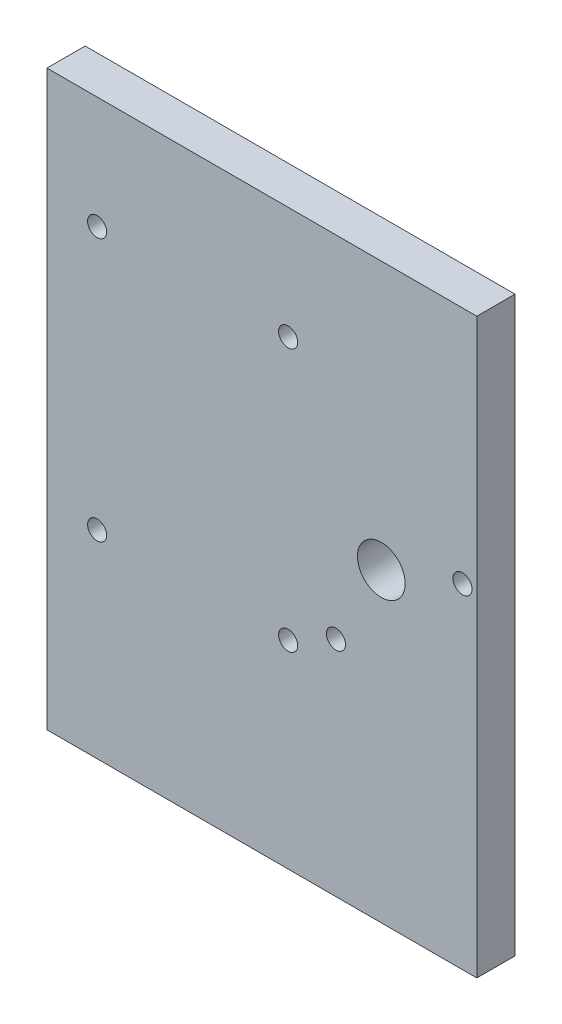
ISO-10303-21;
HEADER;
FILE_DESCRIPTION(('STEP AP214'),'2;1');
FILE_NAME('part.step','',(''),(''),'','','');
FILE_SCHEMA(('AUTOMOTIVE_DESIGN { 1 0 10303 214 1 1 1 1 }'));
ENDSEC;
DATA;
#1=APPLICATION_CONTEXT('core data for automotive mechanical design processes');
#2=APPLICATION_PROTOCOL_DEFINITION('international standard','automotive_design',2000,#1);
#3=PRODUCT_CONTEXT('',#1,'mechanical');
#4=PRODUCT('Part','Part','',(#3));
#5=PRODUCT_RELATED_PRODUCT_CATEGORY('part','',(#4));
#6=PRODUCT_DEFINITION_FORMATION('','',#4);
#7=PRODUCT_DEFINITION_CONTEXT('part definition',#1,'design');
#8=PRODUCT_DEFINITION('design','',#6,#7);
#9=PRODUCT_DEFINITION_SHAPE('','',#8);
#10=(LENGTH_UNIT() NAMED_UNIT(*) SI_UNIT(.MILLI.,.METRE.));
#11=(NAMED_UNIT(*) PLANE_ANGLE_UNIT() SI_UNIT($,.RADIAN.));
#12=(NAMED_UNIT(*) SI_UNIT($,.STERADIAN.) SOLID_ANGLE_UNIT());
#13=UNCERTAINTY_MEASURE_WITH_UNIT(LENGTH_MEASURE(1.E-05),#10,'distance_accuracy_value','');
#14=(GEOMETRIC_REPRESENTATION_CONTEXT(3) GLOBAL_UNCERTAINTY_ASSIGNED_CONTEXT((#13)) GLOBAL_UNIT_ASSIGNED_CONTEXT((#10,
#11,#12)) REPRESENTATION_CONTEXT('',''));
#15=CARTESIAN_POINT('',(0.,0.,0.));
#16=DIRECTION('',(0.,0.,1.));
#17=DIRECTION('',(1.,0.,0.));
#18=AXIS2_PLACEMENT_3D('',#15,#16,#17);
#19=CARTESIAN_POINT('',(0.,0.,8.));
#20=DIRECTION('',(1.,0.,0.));
#21=DIRECTION('',(0.,0.,-1.));
#22=AXIS2_PLACEMENT_3D('',#19,#20,#21);
#23=PLANE('',#22);
#24=DIRECTION('',(0.,-1.,0.));
#25=VECTOR('',#24,1.);
#26=CARTESIAN_POINT('',(0.,0.,0.));
#27=LINE('',#26,#25);
#28=CARTESIAN_POINT('',(0.,120.,0.));
#29=VERTEX_POINT('',#28);
#30=CARTESIAN_POINT('',(0.,0.,0.));
#31=VERTEX_POINT('',#30);
#32=EDGE_CURVE('E96',#29,#31,#27,.T.);
#33=ORIENTED_EDGE('',*,*,#32,.T.);
#34=DIRECTION('',(0.,0.,-1.));
#35=VECTOR('',#34,1.);
#36=CARTESIAN_POINT('',(0.,0.,8.));
#37=LINE('',#36,#35);
#38=CARTESIAN_POINT('',(0.,0.,8.));
#39=VERTEX_POINT('',#38);
#40=EDGE_CURVE('E11',#39,#31,#37,.T.);
#41=ORIENTED_EDGE('',*,*,#40,.F.);
#42=DIRECTION('',(0.,-1.,0.));
#43=VECTOR('',#42,1.);
#44=CARTESIAN_POINT('',(0.,0.,8.));
#45=LINE('',#44,#43);
#46=CARTESIAN_POINT('',(0.,120.,8.));
#47=VERTEX_POINT('',#46);
#48=EDGE_CURVE('E84',#47,#39,#45,.T.);
#49=ORIENTED_EDGE('',*,*,#48,.F.);
#50=DIRECTION('',(0.,0.,-1.));
#51=VECTOR('',#50,1.);
#52=CARTESIAN_POINT('',(0.,120.,8.));
#53=LINE('',#52,#51);
#54=EDGE_CURVE('E92',#47,#29,#53,.T.);
#55=ORIENTED_EDGE('',*,*,#54,.T.);
#56=EDGE_LOOP('',(#33,#41,#49,#55));
#57=FACE_BOUND('',#56,.T.);
#58=ADVANCED_FACE('F33',(#57),#23,.F.);
#59=CARTESIAN_POINT('',(0.,0.,8.));
#60=DIRECTION('',(0.,1.,0.));
#61=DIRECTION('',(0.,0.,1.));
#62=AXIS2_PLACEMENT_3D('',#59,#60,#61);
#63=PLANE('',#62);
#64=DIRECTION('',(1.,0.,0.));
#65=VECTOR('',#64,1.);
#66=CARTESIAN_POINT('',(0.,0.,0.));
#67=LINE('',#66,#65);
#68=CARTESIAN_POINT('',(90.,0.,0.));
#69=VERTEX_POINT('',#68);
#70=EDGE_CURVE('E88',#31,#69,#67,.T.);
#71=ORIENTED_EDGE('',*,*,#70,.T.);
#72=DIRECTION('',(0.,0.,-1.));
#73=VECTOR('',#72,1.);
#74=CARTESIAN_POINT('',(90.,0.,8.));
#75=LINE('',#74,#73);
#76=CARTESIAN_POINT('',(90.,0.,8.));
#77=VERTEX_POINT('',#76);
#78=EDGE_CURVE('E41',#77,#69,#75,.T.);
#79=ORIENTED_EDGE('',*,*,#78,.F.);
#80=DIRECTION('',(1.,0.,0.));
#81=VECTOR('',#80,1.);
#82=CARTESIAN_POINT('',(0.,0.,8.));
#83=LINE('',#82,#81);
#84=EDGE_CURVE('E79',#39,#77,#83,.T.);
#85=ORIENTED_EDGE('',*,*,#84,.F.);
#86=ORIENTED_EDGE('',*,*,#40,.T.);
#87=EDGE_LOOP('',(#71,#79,#85,#86));
#88=FACE_BOUND('',#87,.T.);
#89=ADVANCED_FACE('F87',(#88),#63,.F.);
#90=CARTESIAN_POINT('',(90.,0.,8.));
#91=DIRECTION('',(-1.,0.,0.));
#92=DIRECTION('',(0.,0.,1.));
#93=AXIS2_PLACEMENT_3D('',#90,#91,#92);
#94=PLANE('',#93);
#95=DIRECTION('',(0.,1.,0.));
#96=VECTOR('',#95,1.);
#97=CARTESIAN_POINT('',(90.,0.,0.));
#98=LINE('',#97,#96);
#99=CARTESIAN_POINT('',(90.,120.,0.));
#100=VERTEX_POINT('',#99);
#101=EDGE_CURVE('E66',#69,#100,#98,.T.);
#102=ORIENTED_EDGE('',*,*,#101,.T.);
#103=DIRECTION('',(0.,0.,-1.));
#104=VECTOR('',#103,1.);
#105=CARTESIAN_POINT('',(90.,120.,8.));
#106=LINE('',#105,#104);
#107=CARTESIAN_POINT('',(90.,120.,8.));
#108=VERTEX_POINT('',#107);
#109=EDGE_CURVE('E89',#108,#100,#106,.T.);
#110=ORIENTED_EDGE('',*,*,#109,.F.);
#111=DIRECTION('',(0.,1.,0.));
#112=VECTOR('',#111,1.);
#113=CARTESIAN_POINT('',(90.,0.,8.));
#114=LINE('',#113,#112);
#115=EDGE_CURVE('E82',#77,#108,#114,.T.);
#116=ORIENTED_EDGE('',*,*,#115,.F.);
#117=ORIENTED_EDGE('',*,*,#78,.T.);
#118=EDGE_LOOP('',(#102,#110,#116,#117));
#119=FACE_BOUND('',#118,.T.);
#120=ADVANCED_FACE('F90',(#119),#94,.F.);
#121=CARTESIAN_POINT('',(0.,120.,8.));
#122=DIRECTION('',(0.,-1.,0.));
#123=DIRECTION('',(0.,0.,-1.));
#124=AXIS2_PLACEMENT_3D('',#121,#122,#123);
#125=PLANE('',#124);
#126=DIRECTION('',(-1.,0.,0.));
#127=VECTOR('',#126,1.);
#128=CARTESIAN_POINT('',(0.,120.,0.));
#129=LINE('',#128,#127);
#130=EDGE_CURVE('E72',#100,#29,#129,.T.);
#131=ORIENTED_EDGE('',*,*,#130,.T.);
#132=ORIENTED_EDGE('',*,*,#54,.F.);
#133=DIRECTION('',(-1.,0.,0.));
#134=VECTOR('',#133,1.);
#135=CARTESIAN_POINT('',(0.,120.,8.));
#136=LINE('',#135,#134);
#137=EDGE_CURVE('E49',#108,#47,#136,.T.);
#138=ORIENTED_EDGE('',*,*,#137,.F.);
#139=ORIENTED_EDGE('',*,*,#109,.T.);
#140=EDGE_LOOP('',(#131,#132,#138,#139));
#141=FACE_BOUND('',#140,.T.);
#142=ADVANCED_FACE('F104',(#141),#125,.F.);
#143=CARTESIAN_POINT('',(0.,120.,8.));
#144=DIRECTION('',(0.,0.,-1.));
#145=DIRECTION('',(-1.,0.,0.));
#146=AXIS2_PLACEMENT_3D('',#143,#144,#145);
#147=PLANE('',#146);
#148=CARTESIAN_POINT('',(10.5,41.5,8.));
#149=DIRECTION('',(0.,0.,1.));
#150=DIRECTION('',(1.,0.,0.));
#151=AXIS2_PLACEMENT_3D('',#148,#149,#150);
#152=CIRCLE('',#151,2.);
#153=CARTESIAN_POINT('',(12.5,41.5,8.));
#154=VERTEX_POINT('',#153);
#155=EDGE_CURVE('E146',#154,#154,#152,.T.);
#156=ORIENTED_EDGE('',*,*,#155,.F.);
#157=EDGE_LOOP('',(#156));
#158=FACE_BOUND('',#157,.T.);
#159=CARTESIAN_POINT('',(50.5,41.5,8.));
#160=DIRECTION('',(0.,0.,1.));
#161=DIRECTION('',(1.,0.,0.));
#162=AXIS2_PLACEMENT_3D('',#159,#160,#161);
#163=CIRCLE('',#162,2.);
#164=CARTESIAN_POINT('',(52.5,41.5,8.));
#165=VERTEX_POINT('',#164);
#166=EDGE_CURVE('E140',#165,#165,#163,.T.);
#167=ORIENTED_EDGE('',*,*,#166,.F.);
#168=EDGE_LOOP('',(#167));
#169=FACE_BOUND('',#168,.T.);
#170=CARTESIAN_POINT('',(10.5,96.5,8.));
#171=DIRECTION('',(0.,0.,1.));
#172=DIRECTION('',(1.,0.,0.));
#173=AXIS2_PLACEMENT_3D('',#170,#171,#172);
#174=CIRCLE('',#173,2.);
#175=CARTESIAN_POINT('',(12.5,96.5,8.));
#176=VERTEX_POINT('',#175);
#177=EDGE_CURVE('E134',#176,#176,#174,.T.);
#178=ORIENTED_EDGE('',*,*,#177,.F.);
#179=EDGE_LOOP('',(#178));
#180=FACE_BOUND('',#179,.T.);
#181=CARTESIAN_POINT('',(50.5,96.5,8.));
#182=DIRECTION('',(0.,0.,1.));
#183=DIRECTION('',(1.,0.,0.));
#184=AXIS2_PLACEMENT_3D('',#181,#182,#183);
#185=CIRCLE('',#184,2.);
#186=CARTESIAN_POINT('',(52.5,96.5,8.));
#187=VERTEX_POINT('',#186);
#188=EDGE_CURVE('E128',#187,#187,#185,.T.);
#189=ORIENTED_EDGE('',*,*,#188,.F.);
#190=EDGE_LOOP('',(#189));
#191=FACE_BOUND('',#190,.T.);
#192=CARTESIAN_POINT('',(60.5,46.7,8.));
#193=DIRECTION('',(0.,0.,1.));
#194=DIRECTION('',(1.,0.,0.));
#195=AXIS2_PLACEMENT_3D('',#192,#193,#194);
#196=CIRCLE('',#195,2.);
#197=CARTESIAN_POINT('',(62.5,46.7,8.));
#198=VERTEX_POINT('',#197);
#199=EDGE_CURVE('E122',#198,#198,#196,.T.);
#200=ORIENTED_EDGE('',*,*,#199,.F.);
#201=EDGE_LOOP('',(#200));
#202=FACE_BOUND('',#201,.T.);
#203=CARTESIAN_POINT('',(87.,70.,8.));
#204=DIRECTION('',(0.,0.,1.));
#205=DIRECTION('',(1.,0.,0.));
#206=AXIS2_PLACEMENT_3D('',#203,#204,#205);
#207=CIRCLE('',#206,2.);
#208=CARTESIAN_POINT('',(89.,70.,8.));
#209=VERTEX_POINT('',#208);
#210=EDGE_CURVE('E116',#209,#209,#207,.T.);
#211=ORIENTED_EDGE('',*,*,#210,.F.);
#212=EDGE_LOOP('',(#211));
#213=FACE_BOUND('',#212,.T.);
#214=CARTESIAN_POINT('',(70.,64.,8.));
#215=DIRECTION('',(0.,0.,1.));
#216=DIRECTION('',(1.,0.,0.));
#217=AXIS2_PLACEMENT_3D('',#214,#215,#216);
#218=CIRCLE('',#217,5.00000000000001);
#219=CARTESIAN_POINT('',(75.,64.,8.));
#220=VERTEX_POINT('',#219);
#221=EDGE_CURVE('E110',#220,#220,#218,.T.);
#222=ORIENTED_EDGE('',*,*,#221,.F.);
#223=EDGE_LOOP('',(#222));
#224=FACE_BOUND('',#223,.T.);
#225=ORIENTED_EDGE('',*,*,#48,.T.);
#226=ORIENTED_EDGE('',*,*,#84,.T.);
#227=ORIENTED_EDGE('',*,*,#115,.T.);
#228=ORIENTED_EDGE('',*,*,#137,.T.);
#229=EDGE_LOOP('',(#225,#226,#227,#228));
#230=FACE_BOUND('',#229,.T.);
#231=ADVANCED_FACE('F80',(#158,#169,#180,#191,#202,#213,#224,#230),#147,.F.);
#232=CARTESIAN_POINT('',(0.,120.,0.));
#233=DIRECTION('',(0.,0.,-1.));
#234=DIRECTION('',(-1.,0.,0.));
#235=AXIS2_PLACEMENT_3D('',#232,#233,#234);
#236=PLANE('',#235);
#237=CARTESIAN_POINT('',(10.5,41.5,0.));
#238=DIRECTION('',(0.,0.,1.));
#239=DIRECTION('',(1.,0.,0.));
#240=AXIS2_PLACEMENT_3D('',#237,#238,#239);
#241=CIRCLE('',#240,2.);
#242=CARTESIAN_POINT('',(12.5,41.5,0.));
#243=VERTEX_POINT('',#242);
#244=EDGE_CURVE('E143',#243,#243,#241,.T.);
#245=ORIENTED_EDGE('',*,*,#244,.T.);
#246=EDGE_LOOP('',(#245));
#247=FACE_BOUND('',#246,.T.);
#248=CARTESIAN_POINT('',(50.5,41.5,0.));
#249=DIRECTION('',(0.,0.,1.));
#250=DIRECTION('',(1.,0.,0.));
#251=AXIS2_PLACEMENT_3D('',#248,#249,#250);
#252=CIRCLE('',#251,2.);
#253=CARTESIAN_POINT('',(52.5,41.5,0.));
#254=VERTEX_POINT('',#253);
#255=EDGE_CURVE('E137',#254,#254,#252,.T.);
#256=ORIENTED_EDGE('',*,*,#255,.T.);
#257=EDGE_LOOP('',(#256));
#258=FACE_BOUND('',#257,.T.);
#259=CARTESIAN_POINT('',(10.5,96.5,0.));
#260=DIRECTION('',(0.,0.,1.));
#261=DIRECTION('',(1.,0.,0.));
#262=AXIS2_PLACEMENT_3D('',#259,#260,#261);
#263=CIRCLE('',#262,2.);
#264=CARTESIAN_POINT('',(12.5,96.5,0.));
#265=VERTEX_POINT('',#264);
#266=EDGE_CURVE('E131',#265,#265,#263,.T.);
#267=ORIENTED_EDGE('',*,*,#266,.T.);
#268=EDGE_LOOP('',(#267));
#269=FACE_BOUND('',#268,.T.);
#270=CARTESIAN_POINT('',(50.5,96.5,0.));
#271=DIRECTION('',(0.,0.,1.));
#272=DIRECTION('',(1.,0.,0.));
#273=AXIS2_PLACEMENT_3D('',#270,#271,#272);
#274=CIRCLE('',#273,2.);
#275=CARTESIAN_POINT('',(52.5,96.5,0.));
#276=VERTEX_POINT('',#275);
#277=EDGE_CURVE('E125',#276,#276,#274,.T.);
#278=ORIENTED_EDGE('',*,*,#277,.T.);
#279=EDGE_LOOP('',(#278));
#280=FACE_BOUND('',#279,.T.);
#281=CARTESIAN_POINT('',(60.5,46.7,0.));
#282=DIRECTION('',(0.,0.,1.));
#283=DIRECTION('',(1.,0.,0.));
#284=AXIS2_PLACEMENT_3D('',#281,#282,#283);
#285=CIRCLE('',#284,2.);
#286=CARTESIAN_POINT('',(62.5,46.7,0.));
#287=VERTEX_POINT('',#286);
#288=EDGE_CURVE('E119',#287,#287,#285,.T.);
#289=ORIENTED_EDGE('',*,*,#288,.T.);
#290=EDGE_LOOP('',(#289));
#291=FACE_BOUND('',#290,.T.);
#292=CARTESIAN_POINT('',(87.,70.,0.));
#293=DIRECTION('',(0.,0.,1.));
#294=DIRECTION('',(1.,0.,0.));
#295=AXIS2_PLACEMENT_3D('',#292,#293,#294);
#296=CIRCLE('',#295,2.);
#297=CARTESIAN_POINT('',(89.,70.,0.));
#298=VERTEX_POINT('',#297);
#299=EDGE_CURVE('E113',#298,#298,#296,.T.);
#300=ORIENTED_EDGE('',*,*,#299,.T.);
#301=EDGE_LOOP('',(#300));
#302=FACE_BOUND('',#301,.T.);
#303=CARTESIAN_POINT('',(70.,64.,0.));
#304=DIRECTION('',(0.,0.,1.));
#305=DIRECTION('',(1.,0.,0.));
#306=AXIS2_PLACEMENT_3D('',#303,#304,#305);
#307=CIRCLE('',#306,5.00000000000001);
#308=CARTESIAN_POINT('',(75.,64.,0.));
#309=VERTEX_POINT('',#308);
#310=EDGE_CURVE('E99',#309,#309,#307,.T.);
#311=ORIENTED_EDGE('',*,*,#310,.T.);
#312=EDGE_LOOP('',(#311));
#313=FACE_BOUND('',#312,.T.);
#314=ORIENTED_EDGE('',*,*,#32,.F.);
#315=ORIENTED_EDGE('',*,*,#130,.F.);
#316=ORIENTED_EDGE('',*,*,#101,.F.);
#317=ORIENTED_EDGE('',*,*,#70,.F.);
#318=EDGE_LOOP('',(#314,#315,#316,#317));
#319=FACE_BOUND('',#318,.T.);
#320=ADVANCED_FACE('F107',(#247,#258,#269,#280,#291,#302,#313,#319),#236,.T.);
#321=CARTESIAN_POINT('',(70.,64.,0.));
#322=DIRECTION('',(0.,0.,1.));
#323=DIRECTION('',(1.,0.,0.));
#324=AXIS2_PLACEMENT_3D('',#321,#322,#323);
#325=CYLINDRICAL_SURFACE('',#324,5.00000000000001);
#326=ORIENTED_EDGE('',*,*,#310,.F.);
#327=EDGE_LOOP('',(#326));
#328=FACE_BOUND('',#327,.T.);
#329=ORIENTED_EDGE('',*,*,#221,.T.);
#330=EDGE_LOOP('',(#329));
#331=FACE_BOUND('',#330,.T.);
#332=ADVANCED_FACE('F176',(#328,#331),#325,.F.);
#333=CARTESIAN_POINT('',(87.,70.,0.));
#334=DIRECTION('',(0.,0.,1.));
#335=DIRECTION('',(1.,0.,0.));
#336=AXIS2_PLACEMENT_3D('',#333,#334,#335);
#337=CYLINDRICAL_SURFACE('',#336,2.);
#338=ORIENTED_EDGE('',*,*,#299,.F.);
#339=EDGE_LOOP('',(#338));
#340=FACE_BOUND('',#339,.T.);
#341=ORIENTED_EDGE('',*,*,#210,.T.);
#342=EDGE_LOOP('',(#341));
#343=FACE_BOUND('',#342,.T.);
#344=ADVANCED_FACE('F178',(#340,#343),#337,.F.);
#345=CARTESIAN_POINT('',(60.5,46.7,0.));
#346=DIRECTION('',(0.,0.,1.));
#347=DIRECTION('',(1.,0.,0.));
#348=AXIS2_PLACEMENT_3D('',#345,#346,#347);
#349=CYLINDRICAL_SURFACE('',#348,2.);
#350=ORIENTED_EDGE('',*,*,#288,.F.);
#351=EDGE_LOOP('',(#350));
#352=FACE_BOUND('',#351,.T.);
#353=ORIENTED_EDGE('',*,*,#199,.T.);
#354=EDGE_LOOP('',(#353));
#355=FACE_BOUND('',#354,.T.);
#356=ADVANCED_FACE('F185',(#352,#355),#349,.F.);
#357=CARTESIAN_POINT('',(50.5,96.5,0.));
#358=DIRECTION('',(0.,0.,1.));
#359=DIRECTION('',(1.,0.,0.));
#360=AXIS2_PLACEMENT_3D('',#357,#358,#359);
#361=CYLINDRICAL_SURFACE('',#360,2.);
#362=ORIENTED_EDGE('',*,*,#277,.F.);
#363=EDGE_LOOP('',(#362));
#364=FACE_BOUND('',#363,.T.);
#365=ORIENTED_EDGE('',*,*,#188,.T.);
#366=EDGE_LOOP('',(#365));
#367=FACE_BOUND('',#366,.T.);
#368=ADVANCED_FACE('F219',(#364,#367),#361,.F.);
#369=CARTESIAN_POINT('',(10.5,96.5,0.));
#370=DIRECTION('',(0.,0.,1.));
#371=DIRECTION('',(1.,0.,0.));
#372=AXIS2_PLACEMENT_3D('',#369,#370,#371);
#373=CYLINDRICAL_SURFACE('',#372,2.);
#374=ORIENTED_EDGE('',*,*,#266,.F.);
#375=EDGE_LOOP('',(#374));
#376=FACE_BOUND('',#375,.T.);
#377=ORIENTED_EDGE('',*,*,#177,.T.);
#378=EDGE_LOOP('',(#377));
#379=FACE_BOUND('',#378,.T.);
#380=ADVANCED_FACE('F224',(#376,#379),#373,.F.);
#381=CARTESIAN_POINT('',(50.5,41.5,0.));
#382=DIRECTION('',(0.,0.,1.));
#383=DIRECTION('',(1.,0.,0.));
#384=AXIS2_PLACEMENT_3D('',#381,#382,#383);
#385=CYLINDRICAL_SURFACE('',#384,2.);
#386=ORIENTED_EDGE('',*,*,#255,.F.);
#387=EDGE_LOOP('',(#386));
#388=FACE_BOUND('',#387,.T.);
#389=ORIENTED_EDGE('',*,*,#166,.T.);
#390=EDGE_LOOP('',(#389));
#391=FACE_BOUND('',#390,.T.);
#392=ADVANCED_FACE('F157',(#388,#391),#385,.F.);
#393=CARTESIAN_POINT('',(10.5,41.5,0.));
#394=DIRECTION('',(0.,0.,1.));
#395=DIRECTION('',(1.,0.,0.));
#396=AXIS2_PLACEMENT_3D('',#393,#394,#395);
#397=CYLINDRICAL_SURFACE('',#396,2.);
#398=ORIENTED_EDGE('',*,*,#244,.F.);
#399=EDGE_LOOP('',(#398));
#400=FACE_BOUND('',#399,.T.);
#401=ORIENTED_EDGE('',*,*,#155,.T.);
#402=EDGE_LOOP('',(#401));
#403=FACE_BOUND('',#402,.T.);
#404=ADVANCED_FACE('F154',(#400,#403),#397,.F.);
#405=CLOSED_SHELL('',(#58,#89,#120,#142,#231,#320,#332,#344,#356,#368,#380,#392,#404));
#406=MANIFOLD_SOLID_BREP('B2',#405);
#407=ADVANCED_BREP_SHAPE_REPRESENTATION('',(#18,#406),#14);
#408=SHAPE_DEFINITION_REPRESENTATION(#9,#407);
ENDSEC;
END-ISO-10303-21;
